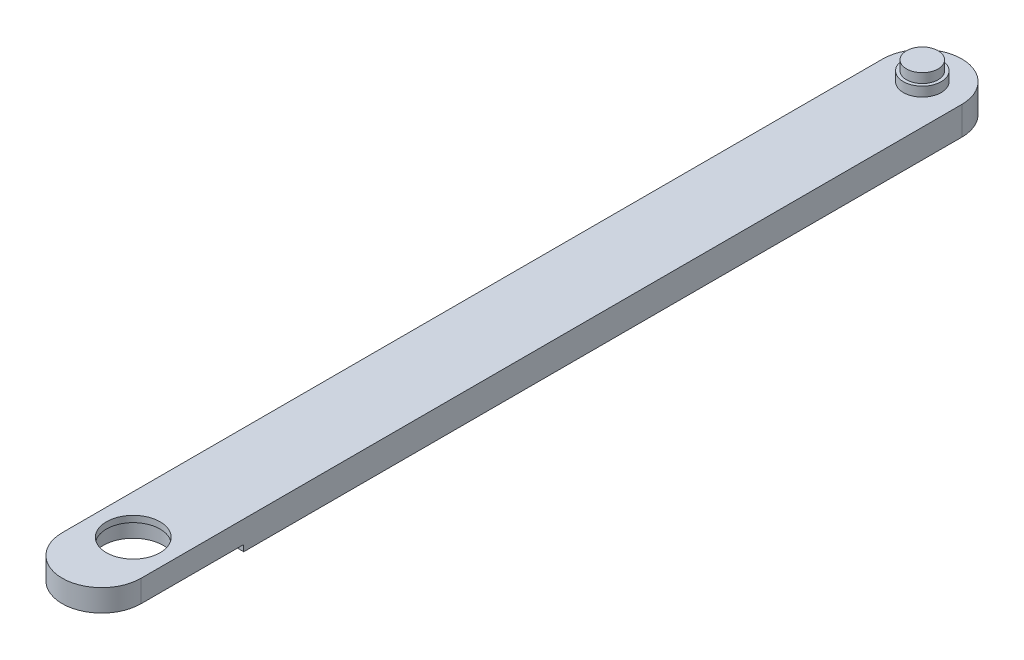
ISO-10303-21;
HEADER;
FILE_DESCRIPTION(('STEP AP214'),'2;1');
FILE_NAME('part.step','',(''),(''),'','','');
FILE_SCHEMA(('AUTOMOTIVE_DESIGN { 1 0 10303 214 1 1 1 1 }'));
ENDSEC;
DATA;
#1=APPLICATION_CONTEXT('core data for automotive mechanical design processes');
#2=APPLICATION_PROTOCOL_DEFINITION('international standard','automotive_design',2000,#1);
#3=PRODUCT_CONTEXT('',#1,'mechanical');
#4=PRODUCT('Part','Part','',(#3));
#5=PRODUCT_RELATED_PRODUCT_CATEGORY('part','',(#4));
#6=PRODUCT_DEFINITION_FORMATION('','',#4);
#7=PRODUCT_DEFINITION_CONTEXT('part definition',#1,'design');
#8=PRODUCT_DEFINITION('design','',#6,#7);
#9=PRODUCT_DEFINITION_SHAPE('','',#8);
#10=(LENGTH_UNIT() NAMED_UNIT(*) SI_UNIT(.MILLI.,.METRE.));
#11=(NAMED_UNIT(*) PLANE_ANGLE_UNIT() SI_UNIT($,.RADIAN.));
#12=(NAMED_UNIT(*) SI_UNIT($,.STERADIAN.) SOLID_ANGLE_UNIT());
#13=UNCERTAINTY_MEASURE_WITH_UNIT(LENGTH_MEASURE(1.E-05),#10,'distance_accuracy_value','');
#14=(GEOMETRIC_REPRESENTATION_CONTEXT(3) GLOBAL_UNCERTAINTY_ASSIGNED_CONTEXT((#13)) GLOBAL_UNIT_ASSIGNED_CONTEXT((#10,
#11,#12)) REPRESENTATION_CONTEXT('',''));
#15=CARTESIAN_POINT('',(0.,0.,0.));
#16=DIRECTION('',(0.,0.,1.));
#17=DIRECTION('',(1.,0.,0.));
#18=AXIS2_PLACEMENT_3D('',#15,#16,#17);
#19=CARTESIAN_POINT('',(0.,-4.5,0.));
#20=DIRECTION('',(0.,1.,0.));
#21=DIRECTION('',(0.,0.,1.));
#22=AXIS2_PLACEMENT_3D('',#19,#20,#21);
#23=CYLINDRICAL_SURFACE('',#22,12.5);
#24=DIRECTION('',(0.,1.,0.));
#25=VECTOR('',#24,1.);
#26=CARTESIAN_POINT('',(-12.5,-4.5,0.));
#27=LINE('',#26,#25);
#28=CARTESIAN_POINT('',(-12.5,-4.5,0.));
#29=VERTEX_POINT('',#28);
#30=CARTESIAN_POINT('',(-12.5,4.5,0.));
#31=VERTEX_POINT('',#30);
#32=EDGE_CURVE('E150',#29,#31,#27,.T.);
#33=ORIENTED_EDGE('',*,*,#32,.T.);
#34=CARTESIAN_POINT('',(0.,4.5,0.));
#35=DIRECTION('',(0.,1.,0.));
#36=DIRECTION('',(0.,0.,1.));
#37=AXIS2_PLACEMENT_3D('',#34,#35,#36);
#38=CIRCLE('',#37,12.5);
#39=CARTESIAN_POINT('',(12.5,4.5,0.));
#40=VERTEX_POINT('',#39);
#41=EDGE_CURVE('E133',#40,#31,#38,.T.);
#42=ORIENTED_EDGE('',*,*,#41,.F.);
#43=DIRECTION('',(0.,1.,0.));
#44=VECTOR('',#43,1.);
#45=CARTESIAN_POINT('',(12.5,-4.5,0.));
#46=LINE('',#45,#44);
#47=CARTESIAN_POINT('',(12.5,-4.5,0.));
#48=VERTEX_POINT('',#47);
#49=EDGE_CURVE('E151',#48,#40,#46,.T.);
#50=ORIENTED_EDGE('',*,*,#49,.F.);
#51=CARTESIAN_POINT('',(0.,-4.5,0.));
#52=DIRECTION('',(0.,1.,0.));
#53=DIRECTION('',(0.,0.,1.));
#54=AXIS2_PLACEMENT_3D('',#51,#52,#53);
#55=CIRCLE('',#54,12.5);
#56=EDGE_CURVE('E145',#48,#29,#55,.T.);
#57=ORIENTED_EDGE('',*,*,#56,.T.);
#58=EDGE_LOOP('',(#33,#42,#50,#57));
#59=FACE_BOUND('',#58,.T.);
#60=ADVANCED_FACE('F35',(#59),#23,.T.);
#61=CARTESIAN_POINT('',(12.5,-4.5,0.));
#62=DIRECTION('',(1.,0.,0.));
#63=DIRECTION('',(0.,0.,-1.));
#64=AXIS2_PLACEMENT_3D('',#61,#62,#63);
#65=PLANE('',#64);
#66=DIRECTION('',(0.,-1.,0.));
#67=VECTOR('',#66,1.);
#68=CARTESIAN_POINT('',(12.5,-2.5,227.5));
#69=LINE('',#68,#67);
#70=CARTESIAN_POINT('',(12.5,-2.5,227.5));
#71=VERTEX_POINT('',#70);
#72=CARTESIAN_POINT('',(12.5,-4.5,227.5));
#73=VERTEX_POINT('',#72);
#74=EDGE_CURVE('E104',#71,#73,#69,.T.);
#75=ORIENTED_EDGE('',*,*,#74,.T.);
#76=DIRECTION('',(0.,0.,-1.));
#77=VECTOR('',#76,1.);
#78=CARTESIAN_POINT('',(12.5,-4.5,0.));
#79=LINE('',#78,#77);
#80=EDGE_CURVE('E60',#73,#48,#79,.T.);
#81=ORIENTED_EDGE('',*,*,#80,.T.);
#82=ORIENTED_EDGE('',*,*,#49,.T.);
#83=DIRECTION('',(0.,0.,-1.));
#84=VECTOR('',#83,1.);
#85=CARTESIAN_POINT('',(12.5,4.5,0.));
#86=LINE('',#85,#84);
#87=CARTESIAN_POINT('',(12.5,4.5,260.));
#88=VERTEX_POINT('',#87);
#89=EDGE_CURVE('E142',#88,#40,#86,.T.);
#90=ORIENTED_EDGE('',*,*,#89,.F.);
#91=DIRECTION('',(0.,1.,0.));
#92=VECTOR('',#91,1.);
#93=CARTESIAN_POINT('',(12.5,-4.5,260.));
#94=LINE('',#93,#92);
#95=CARTESIAN_POINT('',(12.5,-2.5,260.));
#96=VERTEX_POINT('',#95);
#97=EDGE_CURVE('E154',#96,#88,#94,.T.);
#98=ORIENTED_EDGE('',*,*,#97,.F.);
#99=DIRECTION('',(0.,0.,1.));
#100=VECTOR('',#99,1.);
#101=CARTESIAN_POINT('',(12.5,-2.5,227.5));
#102=LINE('',#101,#100);
#103=EDGE_CURVE('E105',#71,#96,#102,.T.);
#104=ORIENTED_EDGE('',*,*,#103,.F.);
#105=EDGE_LOOP('',(#75,#81,#82,#90,#98,#104));
#106=FACE_BOUND('',#105,.T.);
#107=ADVANCED_FACE('F191',(#106),#65,.T.);
#108=CARTESIAN_POINT('',(0.,-4.5,260.));
#109=DIRECTION('',(0.,1.,0.));
#110=DIRECTION('',(0.,0.,1.));
#111=AXIS2_PLACEMENT_3D('',#108,#109,#110);
#112=CYLINDRICAL_SURFACE('',#111,12.5);
#113=CARTESIAN_POINT('',(0.,-2.5,260.));
#114=DIRECTION('',(0.,1.,0.));
#115=DIRECTION('',(0.,0.,1.));
#116=AXIS2_PLACEMENT_3D('',#113,#114,#115);
#117=CIRCLE('',#116,12.5);
#118=CARTESIAN_POINT('',(-12.5,-2.5,260.));
#119=VERTEX_POINT('',#118);
#120=EDGE_CURVE('E98',#96,#119,#117,.F.);
#121=ORIENTED_EDGE('',*,*,#120,.F.);
#122=ORIENTED_EDGE('',*,*,#97,.T.);
#123=CARTESIAN_POINT('',(0.,4.5,260.));
#124=DIRECTION('',(0.,1.,0.));
#125=DIRECTION('',(0.,0.,1.));
#126=AXIS2_PLACEMENT_3D('',#123,#124,#125);
#127=CIRCLE('',#126,12.5);
#128=CARTESIAN_POINT('',(-12.4999999999999,4.5,260.));
#129=VERTEX_POINT('',#128);
#130=EDGE_CURVE('E139',#129,#88,#127,.T.);
#131=ORIENTED_EDGE('',*,*,#130,.F.);
#132=DIRECTION('',(0.,1.,0.));
#133=VECTOR('',#132,1.);
#134=CARTESIAN_POINT('',(-12.4999999999999,-4.5,260.));
#135=LINE('',#134,#133);
#136=EDGE_CURVE('E156',#119,#129,#135,.T.);
#137=ORIENTED_EDGE('',*,*,#136,.F.);
#138=EDGE_LOOP('',(#121,#122,#131,#137));
#139=FACE_BOUND('',#138,.T.);
#140=ADVANCED_FACE('F189',(#139),#112,.T.);
#141=CARTESIAN_POINT('',(-12.5,-4.5,0.));
#142=DIRECTION('',(-1.,0.,0.));
#143=DIRECTION('',(0.,0.,1.));
#144=AXIS2_PLACEMENT_3D('',#141,#142,#143);
#145=PLANE('',#144);
#146=DIRECTION('',(0.,-1.,0.));
#147=VECTOR('',#146,1.);
#148=CARTESIAN_POINT('',(-12.5,-2.5,227.5));
#149=LINE('',#148,#147);
#150=CARTESIAN_POINT('',(-12.5,-2.5,227.5));
#151=VERTEX_POINT('',#150);
#152=CARTESIAN_POINT('',(-12.5,-4.5,227.5));
#153=VERTEX_POINT('',#152);
#154=EDGE_CURVE('E52',#151,#153,#149,.T.);
#155=ORIENTED_EDGE('',*,*,#154,.F.);
#156=DIRECTION('',(0.,0.,-1.));
#157=VECTOR('',#156,1.);
#158=CARTESIAN_POINT('',(-12.5,-2.5,227.5));
#159=LINE('',#158,#157);
#160=EDGE_CURVE('E92',#119,#151,#159,.T.);
#161=ORIENTED_EDGE('',*,*,#160,.F.);
#162=ORIENTED_EDGE('',*,*,#136,.T.);
#163=DIRECTION('',(0.,0.,1.));
#164=VECTOR('',#163,1.);
#165=CARTESIAN_POINT('',(-12.5,4.5,0.));
#166=LINE('',#165,#164);
#167=EDGE_CURVE('E136',#31,#129,#166,.T.);
#168=ORIENTED_EDGE('',*,*,#167,.F.);
#169=ORIENTED_EDGE('',*,*,#32,.F.);
#170=DIRECTION('',(0.,0.,1.));
#171=VECTOR('',#170,1.);
#172=CARTESIAN_POINT('',(-12.5,-4.5,0.));
#173=LINE('',#172,#171);
#174=EDGE_CURVE('E110',#29,#153,#173,.T.);
#175=ORIENTED_EDGE('',*,*,#174,.T.);
#176=EDGE_LOOP('',(#155,#161,#162,#168,#169,#175));
#177=FACE_BOUND('',#176,.T.);
#178=ADVANCED_FACE('F108',(#177),#145,.T.);
#179=CARTESIAN_POINT('',(0.,-4.5,0.));
#180=DIRECTION('',(0.,1.,0.));
#181=DIRECTION('',(0.,0.,1.));
#182=AXIS2_PLACEMENT_3D('',#179,#180,#181);
#183=PLANE('',#182);
#184=CARTESIAN_POINT('',(0.,-4.5,0.));
#185=DIRECTION('',(0.,1.,0.));
#186=DIRECTION('',(0.,0.,1.));
#187=AXIS2_PLACEMENT_3D('',#184,#185,#186);
#188=CIRCLE('',#187,6.);
#189=CARTESIAN_POINT('',(0.,-4.5,6.));
#190=VERTEX_POINT('',#189);
#191=EDGE_CURVE('E164',#190,#190,#188,.F.);
#192=ORIENTED_EDGE('',*,*,#191,.F.);
#193=EDGE_LOOP('',(#192));
#194=FACE_BOUND('',#193,.T.);
#195=ORIENTED_EDGE('',*,*,#80,.F.);
#196=DIRECTION('',(1.,0.,0.));
#197=VECTOR('',#196,1.);
#198=CARTESIAN_POINT('',(-12.5,-4.5,227.5));
#199=LINE('',#198,#197);
#200=EDGE_CURVE('E101',#153,#73,#199,.T.);
#201=ORIENTED_EDGE('',*,*,#200,.F.);
#202=ORIENTED_EDGE('',*,*,#174,.F.);
#203=ORIENTED_EDGE('',*,*,#56,.F.);
#204=EDGE_LOOP('',(#195,#201,#202,#203));
#205=FACE_BOUND('',#204,.T.);
#206=ADVANCED_FACE('F178',(#194,#205),#183,.F.);
#207=CARTESIAN_POINT('',(0.,4.5,0.));
#208=DIRECTION('',(0.,1.,0.));
#209=DIRECTION('',(0.,0.,1.));
#210=AXIS2_PLACEMENT_3D('',#207,#208,#209);
#211=PLANE('',#210);
#212=CARTESIAN_POINT('',(0.,4.5,250.));
#213=DIRECTION('',(0.,1.,0.));
#214=DIRECTION('',(0.,0.,1.));
#215=AXIS2_PLACEMENT_3D('',#212,#213,#214);
#216=CIRCLE('',#215,8.50000000000001);
#217=CARTESIAN_POINT('',(0.,4.5,258.5));
#218=VERTEX_POINT('',#217);
#219=EDGE_CURVE('E120',#218,#218,#216,.T.);
#220=ORIENTED_EDGE('',*,*,#219,.F.);
#221=EDGE_LOOP('',(#220));
#222=FACE_BOUND('',#221,.T.);
#223=CARTESIAN_POINT('',(0.,4.5,0.));
#224=DIRECTION('',(0.,1.,0.));
#225=DIRECTION('',(0.,0.,1.));
#226=AXIS2_PLACEMENT_3D('',#223,#224,#225);
#227=CIRCLE('',#226,6.);
#228=CARTESIAN_POINT('',(0.,4.5,6.));
#229=VERTEX_POINT('',#228);
#230=EDGE_CURVE('E124',#229,#229,#227,.T.);
#231=ORIENTED_EDGE('',*,*,#230,.F.);
#232=EDGE_LOOP('',(#231));
#233=FACE_BOUND('',#232,.T.);
#234=ORIENTED_EDGE('',*,*,#41,.T.);
#235=ORIENTED_EDGE('',*,*,#167,.T.);
#236=ORIENTED_EDGE('',*,*,#130,.T.);
#237=ORIENTED_EDGE('',*,*,#89,.T.);
#238=EDGE_LOOP('',(#234,#235,#236,#237));
#239=FACE_BOUND('',#238,.T.);
#240=ADVANCED_FACE('F174',(#222,#233,#239),#211,.T.);
#241=CARTESIAN_POINT('',(0.,-7.5,0.));
#242=DIRECTION('',(0.,1.,0.));
#243=DIRECTION('',(0.,0.,1.));
#244=AXIS2_PLACEMENT_3D('',#241,#242,#243);
#245=CYLINDRICAL_SURFACE('',#244,6.);
#246=CARTESIAN_POINT('',(0.,-7.5,0.));
#247=DIRECTION('',(0.,-1.,0.));
#248=DIRECTION('',(0.,0.,-1.));
#249=AXIS2_PLACEMENT_3D('',#246,#247,#248);
#250=CIRCLE('',#249,6.);
#251=CARTESIAN_POINT('',(0.,-7.5,-6.));
#252=VERTEX_POINT('',#251);
#253=EDGE_CURVE('E128',#252,#252,#250,.T.);
#254=ORIENTED_EDGE('',*,*,#253,.F.);
#255=EDGE_LOOP('',(#254));
#256=FACE_BOUND('',#255,.T.);
#257=ORIENTED_EDGE('',*,*,#191,.T.);
#258=EDGE_LOOP('',(#257));
#259=FACE_BOUND('',#258,.T.);
#260=ADVANCED_FACE('F177',(#256,#259),#245,.T.);
#261=CARTESIAN_POINT('',(0.,-7.5,0.));
#262=DIRECTION('',(0.,-1.,0.));
#263=DIRECTION('',(0.,0.,-1.));
#264=AXIS2_PLACEMENT_3D('',#261,#262,#263);
#265=PLANE('',#264);
#266=CARTESIAN_POINT('',(0.,-7.5,0.));
#267=DIRECTION('',(0.,-1.,0.));
#268=DIRECTION('',(0.,0.,-1.));
#269=AXIS2_PLACEMENT_3D('',#266,#267,#268);
#270=CIRCLE('',#269,5.);
#271=CARTESIAN_POINT('',(0.,-7.5,-5.));
#272=VERTEX_POINT('',#271);
#273=EDGE_CURVE('E44',#272,#272,#270,.F.);
#274=ORIENTED_EDGE('',*,*,#273,.T.);
#275=EDGE_LOOP('',(#274));
#276=FACE_BOUND('',#275,.T.);
#277=ORIENTED_EDGE('',*,*,#253,.T.);
#278=EDGE_LOOP('',(#277));
#279=FACE_BOUND('',#278,.T.);
#280=ADVANCED_FACE('F216',(#276,#279),#265,.T.);
#281=CARTESIAN_POINT('',(0.,-10.5,0.));
#282=DIRECTION('',(0.,1.,0.));
#283=DIRECTION('',(0.,0.,1.));
#284=AXIS2_PLACEMENT_3D('',#281,#282,#283);
#285=PLANE('',#284);
#286=CARTESIAN_POINT('',(0.,-10.5,0.));
#287=DIRECTION('',(0.,1.,0.));
#288=DIRECTION('',(0.,0.,1.));
#289=AXIS2_PLACEMENT_3D('',#286,#287,#288);
#290=CIRCLE('',#289,5.);
#291=CARTESIAN_POINT('',(0.,-10.5,5.));
#292=VERTEX_POINT('',#291);
#293=EDGE_CURVE('E161',#292,#292,#290,.T.);
#294=ORIENTED_EDGE('',*,*,#293,.F.);
#295=EDGE_LOOP('',(#294));
#296=FACE_BOUND('',#295,.T.);
#297=ADVANCED_FACE('F213',(#296),#285,.F.);
#298=CARTESIAN_POINT('',(0.,-10.5,0.));
#299=DIRECTION('',(0.,1.,0.));
#300=DIRECTION('',(0.,0.,1.));
#301=AXIS2_PLACEMENT_3D('',#298,#299,#300);
#302=CYLINDRICAL_SURFACE('',#301,5.);
#303=ORIENTED_EDGE('',*,*,#273,.F.);
#304=EDGE_LOOP('',(#303));
#305=FACE_BOUND('',#304,.T.);
#306=ORIENTED_EDGE('',*,*,#293,.T.);
#307=EDGE_LOOP('',(#306));
#308=FACE_BOUND('',#307,.T.);
#309=ADVANCED_FACE('F215',(#305,#308),#302,.T.);
#310=CARTESIAN_POINT('',(0.,7.5,0.));
#311=DIRECTION('',(0.,-1.,0.));
#312=DIRECTION('',(0.,0.,-1.));
#313=AXIS2_PLACEMENT_3D('',#310,#311,#312);
#314=CYLINDRICAL_SURFACE('',#313,6.);
#315=CARTESIAN_POINT('',(0.,7.5,0.));
#316=DIRECTION('',(0.,1.,0.));
#317=DIRECTION('',(0.,0.,1.));
#318=AXIS2_PLACEMENT_3D('',#315,#316,#317);
#319=CIRCLE('',#318,6.);
#320=CARTESIAN_POINT('',(0.,7.5,6.));
#321=VERTEX_POINT('',#320);
#322=EDGE_CURVE('E125',#321,#321,#319,.T.);
#323=ORIENTED_EDGE('',*,*,#322,.F.);
#324=EDGE_LOOP('',(#323));
#325=FACE_BOUND('',#324,.T.);
#326=ORIENTED_EDGE('',*,*,#230,.T.);
#327=EDGE_LOOP('',(#326));
#328=FACE_BOUND('',#327,.T.);
#329=ADVANCED_FACE('F222',(#325,#328),#314,.T.);
#330=CARTESIAN_POINT('',(0.,7.5,0.));
#331=DIRECTION('',(0.,1.,0.));
#332=DIRECTION('',(0.,0.,1.));
#333=AXIS2_PLACEMENT_3D('',#330,#331,#332);
#334=PLANE('',#333);
#335=CARTESIAN_POINT('',(0.,7.5,0.));
#336=DIRECTION('',(0.,1.,0.));
#337=DIRECTION('',(0.,0.,1.));
#338=AXIS2_PLACEMENT_3D('',#335,#336,#337);
#339=CIRCLE('',#338,5.);
#340=CARTESIAN_POINT('',(0.,7.5,5.));
#341=VERTEX_POINT('',#340);
#342=EDGE_CURVE('E11',#341,#341,#339,.F.);
#343=ORIENTED_EDGE('',*,*,#342,.T.);
#344=EDGE_LOOP('',(#343));
#345=FACE_BOUND('',#344,.T.);
#346=ORIENTED_EDGE('',*,*,#322,.T.);
#347=EDGE_LOOP('',(#346));
#348=FACE_BOUND('',#347,.T.);
#349=ADVANCED_FACE('F211',(#345,#348),#334,.T.);
#350=CARTESIAN_POINT('',(0.,10.5,0.));
#351=DIRECTION('',(0.,1.,0.));
#352=DIRECTION('',(0.,0.,1.));
#353=AXIS2_PLACEMENT_3D('',#350,#351,#352);
#354=PLANE('',#353);
#355=CARTESIAN_POINT('',(0.,10.5,0.));
#356=DIRECTION('',(0.,1.,0.));
#357=DIRECTION('',(0.,0.,1.));
#358=AXIS2_PLACEMENT_3D('',#355,#356,#357);
#359=CIRCLE('',#358,5.);
#360=CARTESIAN_POINT('',(0.,10.5,5.));
#361=VERTEX_POINT('',#360);
#362=EDGE_CURVE('E153',#361,#361,#359,.T.);
#363=ORIENTED_EDGE('',*,*,#362,.T.);
#364=EDGE_LOOP('',(#363));
#365=FACE_BOUND('',#364,.T.);
#366=ADVANCED_FACE('F209',(#365),#354,.T.);
#367=ORIENTED_EDGE('',*,*,#342,.F.);
#368=EDGE_LOOP('',(#367));
#369=FACE_BOUND('',#368,.T.);
#370=ORIENTED_EDGE('',*,*,#362,.F.);
#371=EDGE_LOOP('',(#370));
#372=FACE_BOUND('',#371,.T.);
#373=ADVANCED_FACE('F37',(#369,#372),#302,.T.);
#374=CARTESIAN_POINT('',(0.,2.5,250.));
#375=DIRECTION('',(0.,-1.,0.));
#376=DIRECTION('',(0.,0.,-1.));
#377=AXIS2_PLACEMENT_3D('',#374,#375,#376);
#378=CYLINDRICAL_SURFACE('',#377,9.50000000000001);
#379=CARTESIAN_POINT('',(0.,-2.5,250.));
#380=DIRECTION('',(0.,1.,0.));
#381=DIRECTION('',(0.,0.,1.));
#382=AXIS2_PLACEMENT_3D('',#379,#380,#381);
#383=CIRCLE('',#382,9.50000000000001);
#384=CARTESIAN_POINT('',(0.,-2.5,259.5));
#385=VERTEX_POINT('',#384);
#386=EDGE_CURVE('E39',#385,#385,#383,.F.);
#387=ORIENTED_EDGE('',*,*,#386,.T.);
#388=EDGE_LOOP('',(#387));
#389=FACE_BOUND('',#388,.T.);
#390=CARTESIAN_POINT('',(0.,2.5,250.));
#391=DIRECTION('',(0.,-1.,0.));
#392=DIRECTION('',(0.,0.,-1.));
#393=AXIS2_PLACEMENT_3D('',#390,#391,#392);
#394=CIRCLE('',#393,9.50000000000001);
#395=CARTESIAN_POINT('',(0.,2.5,240.5));
#396=VERTEX_POINT('',#395);
#397=EDGE_CURVE('E121',#396,#396,#394,.T.);
#398=ORIENTED_EDGE('',*,*,#397,.F.);
#399=EDGE_LOOP('',(#398));
#400=FACE_BOUND('',#399,.T.);
#401=ADVANCED_FACE('F241',(#389,#400),#378,.F.);
#402=CARTESIAN_POINT('',(0.,2.5,250.));
#403=DIRECTION('',(0.,-1.,0.));
#404=DIRECTION('',(0.,0.,-1.));
#405=AXIS2_PLACEMENT_3D('',#402,#403,#404);
#406=PLANE('',#405);
#407=CARTESIAN_POINT('',(0.,2.5,250.));
#408=DIRECTION('',(0.,-1.,0.));
#409=DIRECTION('',(0.,0.,-1.));
#410=AXIS2_PLACEMENT_3D('',#407,#408,#409);
#411=CIRCLE('',#410,8.50000000000001);
#412=CARTESIAN_POINT('',(0.,2.5,241.5));
#413=VERTEX_POINT('',#412);
#414=EDGE_CURVE('E117',#413,#413,#411,.T.);
#415=ORIENTED_EDGE('',*,*,#414,.F.);
#416=EDGE_LOOP('',(#415));
#417=FACE_BOUND('',#416,.T.);
#418=ORIENTED_EDGE('',*,*,#397,.T.);
#419=EDGE_LOOP('',(#418));
#420=FACE_BOUND('',#419,.T.);
#421=ADVANCED_FACE('F244',(#417,#420),#406,.T.);
#422=CARTESIAN_POINT('',(0.,10.5,250.));
#423=DIRECTION('',(0.,-1.,0.));
#424=DIRECTION('',(0.,0.,-1.));
#425=AXIS2_PLACEMENT_3D('',#422,#423,#424);
#426=CYLINDRICAL_SURFACE('',#425,8.50000000000001);
#427=ORIENTED_EDGE('',*,*,#219,.T.);
#428=EDGE_LOOP('',(#427));
#429=FACE_BOUND('',#428,.T.);
#430=ORIENTED_EDGE('',*,*,#414,.T.);
#431=EDGE_LOOP('',(#430));
#432=FACE_BOUND('',#431,.T.);
#433=ADVANCED_FACE('F171',(#429,#432),#426,.F.);
#434=CARTESIAN_POINT('',(0.,-2.5,0.));
#435=DIRECTION('',(0.,1.,0.));
#436=DIRECTION('',(0.,0.,1.));
#437=AXIS2_PLACEMENT_3D('',#434,#435,#436);
#438=PLANE('',#437);
#439=ORIENTED_EDGE('',*,*,#120,.T.);
#440=ORIENTED_EDGE('',*,*,#160,.T.);
#441=DIRECTION('',(1.,0.,0.));
#442=VECTOR('',#441,1.);
#443=CARTESIAN_POINT('',(-12.5,-2.5,227.5));
#444=LINE('',#443,#442);
#445=EDGE_CURVE('E96',#151,#71,#444,.T.);
#446=ORIENTED_EDGE('',*,*,#445,.T.);
#447=ORIENTED_EDGE('',*,*,#103,.T.);
#448=EDGE_LOOP('',(#439,#440,#446,#447));
#449=FACE_BOUND('',#448,.T.);
#450=ORIENTED_EDGE('',*,*,#386,.F.);
#451=EDGE_LOOP('',(#450));
#452=FACE_BOUND('',#451,.T.);
#453=ADVANCED_FACE('F93',(#449,#452),#438,.F.);
#454=CARTESIAN_POINT('',(-12.5,-2.5,227.5));
#455=DIRECTION('',(0.,0.,-1.));
#456=DIRECTION('',(-1.,0.,0.));
#457=AXIS2_PLACEMENT_3D('',#454,#455,#456);
#458=PLANE('',#457);
#459=ORIENTED_EDGE('',*,*,#200,.T.);
#460=ORIENTED_EDGE('',*,*,#74,.F.);
#461=ORIENTED_EDGE('',*,*,#445,.F.);
#462=ORIENTED_EDGE('',*,*,#154,.T.);
#463=EDGE_LOOP('',(#459,#460,#461,#462));
#464=FACE_BOUND('',#463,.T.);
#465=ADVANCED_FACE('F103',(#464),#458,.F.);
#466=CLOSED_SHELL('',(#60,#107,#140,#178,#206,#240,#260,#280,#297,#309,#329,#349,#366,#373,#401,
#421,#433,#453,#465));
#467=MANIFOLD_SOLID_BREP('B2',#466);
#468=ADVANCED_BREP_SHAPE_REPRESENTATION('',(#18,#467),#14);
#469=SHAPE_DEFINITION_REPRESENTATION(#9,#468);
ENDSEC;
END-ISO-10303-21;
